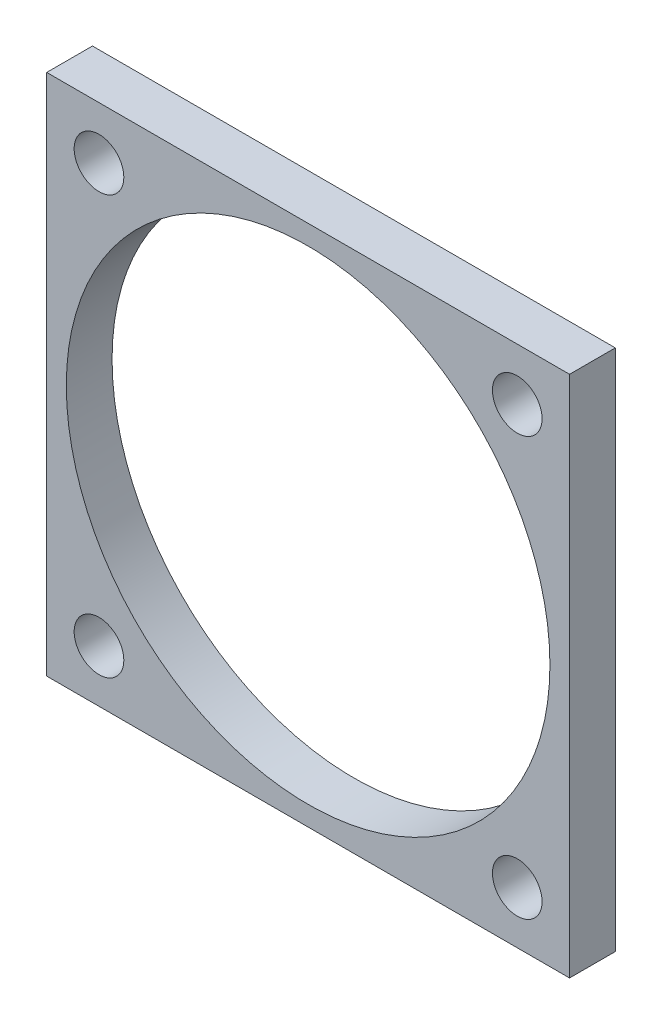
ISO-10303-21;
HEADER;
FILE_DESCRIPTION(('STEP AP214'),'2;1');
FILE_NAME('part.step','',(''),(''),'','','');
FILE_SCHEMA(('AUTOMOTIVE_DESIGN { 1 0 10303 214 1 1 1 1 }'));
ENDSEC;
DATA;
#1=APPLICATION_CONTEXT('core data for automotive mechanical design processes');
#2=APPLICATION_PROTOCOL_DEFINITION('international standard','automotive_design',2000,#1);
#3=PRODUCT_CONTEXT('',#1,'mechanical');
#4=PRODUCT('Part','Part','',(#3));
#5=PRODUCT_RELATED_PRODUCT_CATEGORY('part','',(#4));
#6=PRODUCT_DEFINITION_FORMATION('','',#4);
#7=PRODUCT_DEFINITION_CONTEXT('part definition',#1,'design');
#8=PRODUCT_DEFINITION('design','',#6,#7);
#9=PRODUCT_DEFINITION_SHAPE('','',#8);
#10=(LENGTH_UNIT() NAMED_UNIT(*) SI_UNIT(.MILLI.,.METRE.));
#11=(NAMED_UNIT(*) PLANE_ANGLE_UNIT() SI_UNIT($,.RADIAN.));
#12=(NAMED_UNIT(*) SI_UNIT($,.STERADIAN.) SOLID_ANGLE_UNIT());
#13=UNCERTAINTY_MEASURE_WITH_UNIT(LENGTH_MEASURE(1.E-05),#10,'distance_accuracy_value','');
#14=(GEOMETRIC_REPRESENTATION_CONTEXT(3) GLOBAL_UNCERTAINTY_ASSIGNED_CONTEXT((#13)) GLOBAL_UNIT_ASSIGNED_CONTEXT((#10,
#11,#12)) REPRESENTATION_CONTEXT('',''));
#15=CARTESIAN_POINT('',(0.,0.,0.));
#16=DIRECTION('',(0.,0.,1.));
#17=DIRECTION('',(1.,0.,0.));
#18=AXIS2_PLACEMENT_3D('',#15,#16,#17);
#19=CARTESIAN_POINT('',(0.,0.,3.5));
#20=DIRECTION('',(0.,0.,1.));
#21=DIRECTION('',(1.,0.,0.));
#22=AXIS2_PLACEMENT_3D('',#19,#20,#21);
#23=PLANE('',#22);
#24=CARTESIAN_POINT('',(4.,-36.,3.5));
#25=DIRECTION('',(0.,0.,1.));
#26=DIRECTION('',(1.,0.,0.));
#27=AXIS2_PLACEMENT_3D('',#24,#25,#26);
#28=CIRCLE('',#27,1.9);
#29=CARTESIAN_POINT('',(5.9,-36.,3.5));
#30=VERTEX_POINT('',#29);
#31=EDGE_CURVE('E126',#30,#30,#28,.T.);
#32=ORIENTED_EDGE('',*,*,#31,.F.);
#33=EDGE_LOOP('',(#32));
#34=FACE_BOUND('',#33,.T.);
#35=CARTESIAN_POINT('',(36.,-4.,3.5));
#36=DIRECTION('',(0.,0.,1.));
#37=DIRECTION('',(1.,0.,0.));
#38=AXIS2_PLACEMENT_3D('',#35,#36,#37);
#39=CIRCLE('',#38,1.9);
#40=CARTESIAN_POINT('',(37.9,-4.,3.5));
#41=VERTEX_POINT('',#40);
#42=EDGE_CURVE('E114',#41,#41,#39,.T.);
#43=ORIENTED_EDGE('',*,*,#42,.F.);
#44=EDGE_LOOP('',(#43));
#45=FACE_BOUND('',#44,.T.);
#46=DIRECTION('',(0.,-1.,0.));
#47=VECTOR('',#46,1.);
#48=CARTESIAN_POINT('',(0.,0.,3.5));
#49=LINE('',#48,#47);
#50=CARTESIAN_POINT('',(0.,0.,3.5));
#51=VERTEX_POINT('',#50);
#52=CARTESIAN_POINT('',(0.,-40.,3.5));
#53=VERTEX_POINT('',#52);
#54=EDGE_CURVE('E84',#51,#53,#49,.T.);
#55=ORIENTED_EDGE('',*,*,#54,.T.);
#56=DIRECTION('',(1.,0.,0.));
#57=VECTOR('',#56,1.);
#58=CARTESIAN_POINT('',(0.,-40.,3.5));
#59=LINE('',#58,#57);
#60=CARTESIAN_POINT('',(40.,-40.,3.5));
#61=VERTEX_POINT('',#60);
#62=EDGE_CURVE('E79',#53,#61,#59,.T.);
#63=ORIENTED_EDGE('',*,*,#62,.T.);
#64=DIRECTION('',(0.,1.,0.));
#65=VECTOR('',#64,1.);
#66=CARTESIAN_POINT('',(40.,0.,3.5));
#67=LINE('',#66,#65);
#68=CARTESIAN_POINT('',(40.,0.,3.5));
#69=VERTEX_POINT('',#68);
#70=EDGE_CURVE('E82',#61,#69,#67,.T.);
#71=ORIENTED_EDGE('',*,*,#70,.T.);
#72=DIRECTION('',(-1.,0.,0.));
#73=VECTOR('',#72,1.);
#74=CARTESIAN_POINT('',(0.,0.,3.5));
#75=LINE('',#74,#73);
#76=EDGE_CURVE('E49',#69,#51,#75,.T.);
#77=ORIENTED_EDGE('',*,*,#76,.T.);
#78=EDGE_LOOP('',(#55,#63,#71,#77));
#79=FACE_BOUND('',#78,.T.);
#80=CARTESIAN_POINT('',(4.,-4.,3.5));
#81=DIRECTION('',(0.,0.,1.));
#82=DIRECTION('',(1.,0.,0.));
#83=AXIS2_PLACEMENT_3D('',#80,#81,#82);
#84=CIRCLE('',#83,1.9);
#85=CARTESIAN_POINT('',(5.9,-4.,3.5));
#86=VERTEX_POINT('',#85);
#87=EDGE_CURVE('E99',#86,#86,#84,.T.);
#88=ORIENTED_EDGE('',*,*,#87,.F.);
#89=EDGE_LOOP('',(#88));
#90=FACE_BOUND('',#89,.T.);
#91=CARTESIAN_POINT('',(36.,-36.,3.5));
#92=DIRECTION('',(0.,0.,1.));
#93=DIRECTION('',(1.,0.,0.));
#94=AXIS2_PLACEMENT_3D('',#91,#92,#93);
#95=CIRCLE('',#94,1.9);
#96=CARTESIAN_POINT('',(37.9,-36.,3.5));
#97=VERTEX_POINT('',#96);
#98=EDGE_CURVE('E120',#97,#97,#95,.T.);
#99=ORIENTED_EDGE('',*,*,#98,.F.);
#100=EDGE_LOOP('',(#99));
#101=FACE_BOUND('',#100,.T.);
#102=CARTESIAN_POINT('',(20.,-20.,3.5));
#103=DIRECTION('',(0.,0.,1.));
#104=DIRECTION('',(1.,0.,0.));
#105=AXIS2_PLACEMENT_3D('',#102,#103,#104);
#106=CIRCLE('',#105,18.5);
#107=CARTESIAN_POINT('',(38.5,-20.,3.5));
#108=VERTEX_POINT('',#107);
#109=EDGE_CURVE('E132',#108,#108,#106,.T.);
#110=ORIENTED_EDGE('',*,*,#109,.F.);
#111=EDGE_LOOP('',(#110));
#112=FACE_BOUND('',#111,.T.);
#113=ADVANCED_FACE('F32',(#34,#45,#79,#90,#101,#112),#23,.T.);
#114=CARTESIAN_POINT('',(0.,0.,0.));
#115=DIRECTION('',(0.,0.,1.));
#116=DIRECTION('',(1.,0.,0.));
#117=AXIS2_PLACEMENT_3D('',#114,#115,#116);
#118=PLANE('',#117);
#119=CARTESIAN_POINT('',(4.,-36.,0.));
#120=DIRECTION('',(0.,0.,1.));
#121=DIRECTION('',(1.,0.,0.));
#122=AXIS2_PLACEMENT_3D('',#119,#120,#121);
#123=CIRCLE('',#122,1.9);
#124=CARTESIAN_POINT('',(5.9,-36.,0.));
#125=VERTEX_POINT('',#124);
#126=EDGE_CURVE('E129',#125,#125,#123,.T.);
#127=ORIENTED_EDGE('',*,*,#126,.T.);
#128=EDGE_LOOP('',(#127));
#129=FACE_BOUND('',#128,.T.);
#130=CARTESIAN_POINT('',(36.,-4.,0.));
#131=DIRECTION('',(0.,0.,1.));
#132=DIRECTION('',(1.,0.,0.));
#133=AXIS2_PLACEMENT_3D('',#130,#131,#132);
#134=CIRCLE('',#133,1.9);
#135=CARTESIAN_POINT('',(37.9,-4.,0.));
#136=VERTEX_POINT('',#135);
#137=EDGE_CURVE('E117',#136,#136,#134,.T.);
#138=ORIENTED_EDGE('',*,*,#137,.T.);
#139=EDGE_LOOP('',(#138));
#140=FACE_BOUND('',#139,.T.);
#141=DIRECTION('',(0.,-1.,0.));
#142=VECTOR('',#141,1.);
#143=CARTESIAN_POINT('',(0.,0.,0.));
#144=LINE('',#143,#142);
#145=CARTESIAN_POINT('',(0.,0.,0.));
#146=VERTEX_POINT('',#145);
#147=CARTESIAN_POINT('',(0.,-40.,0.));
#148=VERTEX_POINT('',#147);
#149=EDGE_CURVE('E96',#146,#148,#144,.T.);
#150=ORIENTED_EDGE('',*,*,#149,.F.);
#151=DIRECTION('',(-1.,0.,0.));
#152=VECTOR('',#151,1.);
#153=CARTESIAN_POINT('',(0.,0.,0.));
#154=LINE('',#153,#152);
#155=CARTESIAN_POINT('',(40.,0.,0.));
#156=VERTEX_POINT('',#155);
#157=EDGE_CURVE('E72',#156,#146,#154,.T.);
#158=ORIENTED_EDGE('',*,*,#157,.F.);
#159=DIRECTION('',(0.,1.,0.));
#160=VECTOR('',#159,1.);
#161=CARTESIAN_POINT('',(40.,0.,0.));
#162=LINE('',#161,#160);
#163=CARTESIAN_POINT('',(40.,-40.,0.));
#164=VERTEX_POINT('',#163);
#165=EDGE_CURVE('E66',#164,#156,#162,.T.);
#166=ORIENTED_EDGE('',*,*,#165,.F.);
#167=DIRECTION('',(1.,0.,0.));
#168=VECTOR('',#167,1.);
#169=CARTESIAN_POINT('',(0.,-40.,0.));
#170=LINE('',#169,#168);
#171=EDGE_CURVE('E88',#148,#164,#170,.T.);
#172=ORIENTED_EDGE('',*,*,#171,.F.);
#173=EDGE_LOOP('',(#150,#158,#166,#172));
#174=FACE_BOUND('',#173,.T.);
#175=CARTESIAN_POINT('',(4.,-4.,0.));
#176=DIRECTION('',(0.,0.,1.));
#177=DIRECTION('',(1.,0.,0.));
#178=AXIS2_PLACEMENT_3D('',#175,#176,#177);
#179=CIRCLE('',#178,1.9);
#180=CARTESIAN_POINT('',(5.9,-4.,0.));
#181=VERTEX_POINT('',#180);
#182=EDGE_CURVE('E111',#181,#181,#179,.T.);
#183=ORIENTED_EDGE('',*,*,#182,.T.);
#184=EDGE_LOOP('',(#183));
#185=FACE_BOUND('',#184,.T.);
#186=CARTESIAN_POINT('',(36.,-36.,0.));
#187=DIRECTION('',(0.,0.,1.));
#188=DIRECTION('',(1.,0.,0.));
#189=AXIS2_PLACEMENT_3D('',#186,#187,#188);
#190=CIRCLE('',#189,1.9);
#191=CARTESIAN_POINT('',(37.9,-36.,0.));
#192=VERTEX_POINT('',#191);
#193=EDGE_CURVE('E123',#192,#192,#190,.T.);
#194=ORIENTED_EDGE('',*,*,#193,.T.);
#195=EDGE_LOOP('',(#194));
#196=FACE_BOUND('',#195,.T.);
#197=CARTESIAN_POINT('',(20.,-20.,0.));
#198=DIRECTION('',(0.,0.,1.));
#199=DIRECTION('',(1.,0.,0.));
#200=AXIS2_PLACEMENT_3D('',#197,#198,#199);
#201=CIRCLE('',#200,18.5);
#202=CARTESIAN_POINT('',(38.5,-20.,0.));
#203=VERTEX_POINT('',#202);
#204=EDGE_CURVE('E135',#203,#203,#201,.T.);
#205=ORIENTED_EDGE('',*,*,#204,.T.);
#206=EDGE_LOOP('',(#205));
#207=FACE_BOUND('',#206,.T.);
#208=ADVANCED_FACE('F107',(#129,#140,#174,#185,#196,#207),#118,.F.);
#209=CARTESIAN_POINT('',(0.,0.,3.5));
#210=DIRECTION('',(1.,0.,0.));
#211=DIRECTION('',(0.,1.,0.));
#212=AXIS2_PLACEMENT_3D('',#209,#210,#211);
#213=PLANE('',#212);
#214=ORIENTED_EDGE('',*,*,#149,.T.);
#215=DIRECTION('',(0.,0.,-1.));
#216=VECTOR('',#215,1.);
#217=CARTESIAN_POINT('',(0.,-40.,3.5));
#218=LINE('',#217,#216);
#219=EDGE_CURVE('E11',#53,#148,#218,.T.);
#220=ORIENTED_EDGE('',*,*,#219,.F.);
#221=ORIENTED_EDGE('',*,*,#54,.F.);
#222=DIRECTION('',(0.,0.,-1.));
#223=VECTOR('',#222,1.);
#224=CARTESIAN_POINT('',(0.,0.,3.5));
#225=LINE('',#224,#223);
#226=EDGE_CURVE('E92',#51,#146,#225,.T.);
#227=ORIENTED_EDGE('',*,*,#226,.T.);
#228=EDGE_LOOP('',(#214,#220,#221,#227));
#229=FACE_BOUND('',#228,.T.);
#230=ADVANCED_FACE('F34',(#229),#213,.F.);
#231=CARTESIAN_POINT('',(0.,-40.,3.5));
#232=DIRECTION('',(0.,1.,0.));
#233=DIRECTION('',(0.,0.,1.));
#234=AXIS2_PLACEMENT_3D('',#231,#232,#233);
#235=PLANE('',#234);
#236=ORIENTED_EDGE('',*,*,#171,.T.);
#237=DIRECTION('',(0.,0.,-1.));
#238=VECTOR('',#237,1.);
#239=CARTESIAN_POINT('',(40.,-40.,3.5));
#240=LINE('',#239,#238);
#241=EDGE_CURVE('E41',#61,#164,#240,.T.);
#242=ORIENTED_EDGE('',*,*,#241,.F.);
#243=ORIENTED_EDGE('',*,*,#62,.F.);
#244=ORIENTED_EDGE('',*,*,#219,.T.);
#245=EDGE_LOOP('',(#236,#242,#243,#244));
#246=FACE_BOUND('',#245,.T.);
#247=ADVANCED_FACE('F87',(#246),#235,.F.);
#248=CARTESIAN_POINT('',(40.,0.,3.5));
#249=DIRECTION('',(-1.,0.,0.));
#250=DIRECTION('',(0.,-1.,0.));
#251=AXIS2_PLACEMENT_3D('',#248,#249,#250);
#252=PLANE('',#251);
#253=ORIENTED_EDGE('',*,*,#165,.T.);
#254=DIRECTION('',(0.,0.,-1.));
#255=VECTOR('',#254,1.);
#256=CARTESIAN_POINT('',(40.,0.,3.5));
#257=LINE('',#256,#255);
#258=EDGE_CURVE('E89',#69,#156,#257,.T.);
#259=ORIENTED_EDGE('',*,*,#258,.F.);
#260=ORIENTED_EDGE('',*,*,#70,.F.);
#261=ORIENTED_EDGE('',*,*,#241,.T.);
#262=EDGE_LOOP('',(#253,#259,#260,#261));
#263=FACE_BOUND('',#262,.T.);
#264=ADVANCED_FACE('F90',(#263),#252,.F.);
#265=CARTESIAN_POINT('',(0.,0.,3.5));
#266=DIRECTION('',(0.,-1.,0.));
#267=DIRECTION('',(0.,0.,-1.));
#268=AXIS2_PLACEMENT_3D('',#265,#266,#267);
#269=PLANE('',#268);
#270=ORIENTED_EDGE('',*,*,#157,.T.);
#271=ORIENTED_EDGE('',*,*,#226,.F.);
#272=ORIENTED_EDGE('',*,*,#76,.F.);
#273=ORIENTED_EDGE('',*,*,#258,.T.);
#274=EDGE_LOOP('',(#270,#271,#272,#273));
#275=FACE_BOUND('',#274,.T.);
#276=ADVANCED_FACE('F104',(#275),#269,.F.);
#277=CARTESIAN_POINT('',(4.,-4.,3.5));
#278=DIRECTION('',(0.,0.,-1.));
#279=DIRECTION('',(-1.,0.,0.));
#280=AXIS2_PLACEMENT_3D('',#277,#278,#279);
#281=CYLINDRICAL_SURFACE('',#280,1.9);
#282=ORIENTED_EDGE('',*,*,#87,.T.);
#283=EDGE_LOOP('',(#282));
#284=FACE_BOUND('',#283,.T.);
#285=ORIENTED_EDGE('',*,*,#182,.F.);
#286=EDGE_LOOP('',(#285));
#287=FACE_BOUND('',#286,.T.);
#288=ADVANCED_FACE('F155',(#284,#287),#281,.F.);
#289=CARTESIAN_POINT('',(36.,-4.,3.5));
#290=DIRECTION('',(0.,0.,-1.));
#291=DIRECTION('',(-1.,0.,0.));
#292=AXIS2_PLACEMENT_3D('',#289,#290,#291);
#293=CYLINDRICAL_SURFACE('',#292,1.9);
#294=ORIENTED_EDGE('',*,*,#42,.T.);
#295=EDGE_LOOP('',(#294));
#296=FACE_BOUND('',#295,.T.);
#297=ORIENTED_EDGE('',*,*,#137,.F.);
#298=EDGE_LOOP('',(#297));
#299=FACE_BOUND('',#298,.T.);
#300=ADVANCED_FACE('F201',(#296,#299),#293,.F.);
#301=CARTESIAN_POINT('',(36.,-36.,3.5));
#302=DIRECTION('',(0.,0.,-1.));
#303=DIRECTION('',(-1.,0.,0.));
#304=AXIS2_PLACEMENT_3D('',#301,#302,#303);
#305=CYLINDRICAL_SURFACE('',#304,1.9);
#306=ORIENTED_EDGE('',*,*,#98,.T.);
#307=EDGE_LOOP('',(#306));
#308=FACE_BOUND('',#307,.T.);
#309=ORIENTED_EDGE('',*,*,#193,.F.);
#310=EDGE_LOOP('',(#309));
#311=FACE_BOUND('',#310,.T.);
#312=ADVANCED_FACE('F209',(#308,#311),#305,.F.);
#313=CARTESIAN_POINT('',(4.,-36.,3.5));
#314=DIRECTION('',(0.,0.,-1.));
#315=DIRECTION('',(-1.,0.,0.));
#316=AXIS2_PLACEMENT_3D('',#313,#314,#315);
#317=CYLINDRICAL_SURFACE('',#316,1.9);
#318=ORIENTED_EDGE('',*,*,#31,.T.);
#319=EDGE_LOOP('',(#318));
#320=FACE_BOUND('',#319,.T.);
#321=ORIENTED_EDGE('',*,*,#126,.F.);
#322=EDGE_LOOP('',(#321));
#323=FACE_BOUND('',#322,.T.);
#324=ADVANCED_FACE('F217',(#320,#323),#317,.F.);
#325=CARTESIAN_POINT('',(20.,-20.,3.5));
#326=DIRECTION('',(0.,0.,-1.));
#327=DIRECTION('',(-1.,0.,0.));
#328=AXIS2_PLACEMENT_3D('',#325,#326,#327);
#329=CYLINDRICAL_SURFACE('',#328,18.5);
#330=ORIENTED_EDGE('',*,*,#109,.T.);
#331=EDGE_LOOP('',(#330));
#332=FACE_BOUND('',#331,.T.);
#333=ORIENTED_EDGE('',*,*,#204,.F.);
#334=EDGE_LOOP('',(#333));
#335=FACE_BOUND('',#334,.T.);
#336=ADVANCED_FACE('F141',(#332,#335),#329,.F.);
#337=CLOSED_SHELL('',(#113,#208,#230,#247,#264,#276,#288,#300,#312,#324,#336));
#338=MANIFOLD_SOLID_BREP('B2',#337);
#339=ADVANCED_BREP_SHAPE_REPRESENTATION('',(#18,#338),#14);
#340=SHAPE_DEFINITION_REPRESENTATION(#9,#339);
ENDSEC;
END-ISO-10303-21;
